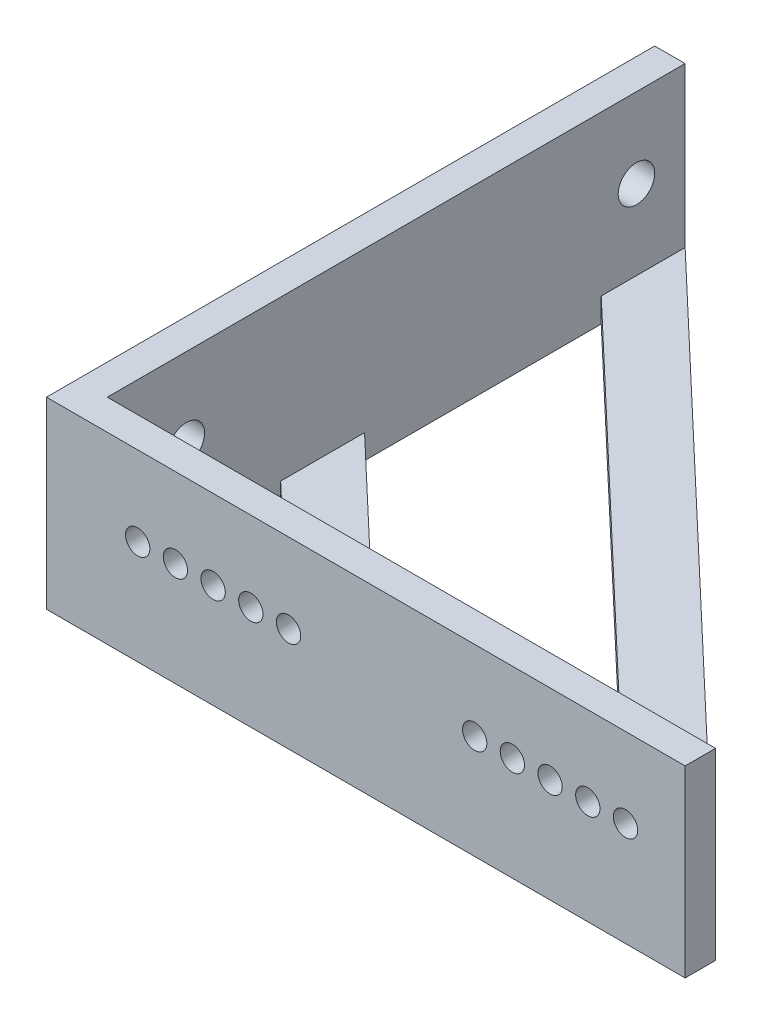
ISO-10303-21;
HEADER;
FILE_DESCRIPTION(('STEP AP214'),'2;1');
FILE_NAME('part.step','',(''),(''),'','','');
FILE_SCHEMA(('AUTOMOTIVE_DESIGN { 1 0 10303 214 1 1 1 1 }'));
ENDSEC;
DATA;
#1=APPLICATION_CONTEXT('core data for automotive mechanical design processes');
#2=APPLICATION_PROTOCOL_DEFINITION('international standard','automotive_design',2000,#1);
#3=PRODUCT_CONTEXT('',#1,'mechanical');
#4=PRODUCT('Part','Part','',(#3));
#5=PRODUCT_RELATED_PRODUCT_CATEGORY('part','',(#4));
#6=PRODUCT_DEFINITION_FORMATION('','',#4);
#7=PRODUCT_DEFINITION_CONTEXT('part definition',#1,'design');
#8=PRODUCT_DEFINITION('design','',#6,#7);
#9=PRODUCT_DEFINITION_SHAPE('','',#8);
#10=(LENGTH_UNIT() NAMED_UNIT(*) SI_UNIT(.MILLI.,.METRE.));
#11=(NAMED_UNIT(*) PLANE_ANGLE_UNIT() SI_UNIT($,.RADIAN.));
#12=(NAMED_UNIT(*) SI_UNIT($,.STERADIAN.) SOLID_ANGLE_UNIT());
#13=UNCERTAINTY_MEASURE_WITH_UNIT(LENGTH_MEASURE(1.E-05),#10,'distance_accuracy_value','');
#14=(GEOMETRIC_REPRESENTATION_CONTEXT(3) GLOBAL_UNCERTAINTY_ASSIGNED_CONTEXT((#13)) GLOBAL_UNIT_ASSIGNED_CONTEXT((#10,
#11,#12)) REPRESENTATION_CONTEXT('',''));
#15=CARTESIAN_POINT('',(0.,0.,0.));
#16=DIRECTION('',(0.,0.,1.));
#17=DIRECTION('',(1.,0.,0.));
#18=AXIS2_PLACEMENT_3D('',#15,#16,#17);
#19=CARTESIAN_POINT('',(100.042086618069,2.,-2.5));
#20=DIRECTION('',(0.,-1.,0.));
#21=DIRECTION('',(0.,0.,-1.));
#22=AXIS2_PLACEMENT_3D('',#19,#20,#21);
#23=PLANE('',#22);
#24=DIRECTION('',(0.,0.,1.));
#25=VECTOR('',#24,1.);
#26=CARTESIAN_POINT('',(2.5,2.,-2.5));
#27=LINE('',#26,#25);
#28=CARTESIAN_POINT('',(2.5,2.,-23.6465571120669));
#29=VERTEX_POINT('',#28);
#30=CARTESIAN_POINT('',(2.5,2.,-16.75));
#31=VERTEX_POINT('',#30);
#32=EDGE_CURVE('E187',#29,#31,#27,.T.);
#33=ORIENTED_EDGE('',*,*,#32,.T.);
#34=DIRECTION('',(-0.724999433594414,0.,-0.688749461914693));
#35=VECTOR('',#34,1.);
#36=CARTESIAN_POINT('',(17.5,2.,-2.5));
#37=LINE('',#36,#35);
#38=CARTESIAN_POINT('',(17.5,2.,-2.5));
#39=VERTEX_POINT('',#38);
#40=EDGE_CURVE('E152',#39,#31,#37,.T.);
#41=ORIENTED_EDGE('',*,*,#40,.F.);
#42=DIRECTION('',(-1.,0.,0.));
#43=VECTOR('',#42,1.);
#44=CARTESIAN_POINT('',(100.042086618069,2.,-2.5));
#45=LINE('',#44,#43);
#46=CARTESIAN_POINT('',(24.7595338021756,2.,-2.5));
#47=VERTEX_POINT('',#46);
#48=EDGE_CURVE('E139',#47,#39,#45,.T.);
#49=ORIENTED_EDGE('',*,*,#48,.F.);
#50=DIRECTION('',(0.724999433594414,0.,0.688749461914693));
#51=VECTOR('',#50,1.);
#52=CARTESIAN_POINT('',(2.5,2.,-23.6465571120669));
#53=LINE('',#52,#51);
#54=EDGE_CURVE('E173',#29,#47,#53,.T.);
#55=ORIENTED_EDGE('',*,*,#54,.F.);
#56=EDGE_LOOP('',(#33,#41,#49,#55));
#57=FACE_BOUND('',#56,.T.);
#58=ADVANCED_FACE('F38',(#57),#23,.F.);
#59=CARTESIAN_POINT('',(2.5,0.,0.));
#60=DIRECTION('',(-1.,0.,0.));
#61=DIRECTION('',(0.,0.,1.));
#62=AXIS2_PLACEMENT_3D('',#59,#60,#61);
#63=PLANE('',#62);
#64=CARTESIAN_POINT('',(2.5,8.55,-46.));
#65=DIRECTION('',(1.,0.,0.));
#66=DIRECTION('',(0.,0.,-1.));
#67=AXIS2_PLACEMENT_3D('',#64,#65,#66);
#68=CIRCLE('',#67,1.5);
#69=CARTESIAN_POINT('',(2.5,8.55,-47.5));
#70=VERTEX_POINT('',#69);
#71=EDGE_CURVE('E279',#70,#70,#68,.T.);
#72=ORIENTED_EDGE('',*,*,#71,.F.);
#73=EDGE_LOOP('',(#72));
#74=FACE_BOUND('',#73,.T.);
#75=CARTESIAN_POINT('',(2.5,8.55,-9.));
#76=DIRECTION('',(1.,0.,0.));
#77=DIRECTION('',(0.,0.,-1.));
#78=AXIS2_PLACEMENT_3D('',#75,#76,#77);
#79=CIRCLE('',#78,1.5);
#80=CARTESIAN_POINT('',(2.5,8.55,-10.5));
#81=VERTEX_POINT('',#80);
#82=EDGE_CURVE('E274',#81,#81,#79,.T.);
#83=ORIENTED_EDGE('',*,*,#82,.F.);
#84=EDGE_LOOP('',(#83));
#85=FACE_BOUND('',#84,.T.);
#86=CARTESIAN_POINT('',(2.5,2.,-50.));
#87=VERTEX_POINT('',#86);
#88=CARTESIAN_POINT('',(2.5,2.,-43.1034428879331));
#89=VERTEX_POINT('',#88);
#90=EDGE_CURVE('E193',#87,#89,#27,.T.);
#91=ORIENTED_EDGE('',*,*,#90,.F.);
#92=DIRECTION('',(0.,1.,0.));
#93=VECTOR('',#92,1.);
#94=CARTESIAN_POINT('',(2.5,0.,-50.));
#95=LINE('',#94,#93);
#96=CARTESIAN_POINT('',(2.5,15.1,-50.));
#97=VERTEX_POINT('',#96);
#98=EDGE_CURVE('E287',#87,#97,#95,.T.);
#99=ORIENTED_EDGE('',*,*,#98,.T.);
#100=DIRECTION('',(0.,0.,1.));
#101=VECTOR('',#100,1.);
#102=CARTESIAN_POINT('',(2.5,15.1,0.));
#103=LINE('',#102,#101);
#104=CARTESIAN_POINT('',(2.5,15.1,-2.5));
#105=VERTEX_POINT('',#104);
#106=EDGE_CURVE('E289',#97,#105,#103,.T.);
#107=ORIENTED_EDGE('',*,*,#106,.T.);
#108=DIRECTION('',(0.,1.,0.));
#109=VECTOR('',#108,1.);
#110=CARTESIAN_POINT('',(2.5,0.,-2.5));
#111=LINE('',#110,#109);
#112=CARTESIAN_POINT('',(2.5,0.,-2.5));
#113=VERTEX_POINT('',#112);
#114=EDGE_CURVE('E258',#113,#105,#111,.T.);
#115=ORIENTED_EDGE('',*,*,#114,.F.);
#116=DIRECTION('',(0.,0.,1.));
#117=VECTOR('',#116,1.);
#118=CARTESIAN_POINT('',(2.5,0.,-2.5));
#119=LINE('',#118,#117);
#120=CARTESIAN_POINT('',(2.5,0.,-16.75));
#121=VERTEX_POINT('',#120);
#122=EDGE_CURVE('E53',#121,#113,#119,.T.);
#123=ORIENTED_EDGE('',*,*,#122,.F.);
#124=DIRECTION('',(0.,1.,0.));
#125=VECTOR('',#124,1.);
#126=CARTESIAN_POINT('',(2.5,0.,-16.75));
#127=LINE('',#126,#125);
#128=EDGE_CURVE('E143',#121,#31,#127,.T.);
#129=ORIENTED_EDGE('',*,*,#128,.T.);
#130=ORIENTED_EDGE('',*,*,#32,.F.);
#131=DIRECTION('',(0.,1.,0.));
#132=VECTOR('',#131,1.);
#133=CARTESIAN_POINT('',(2.5,0.,-23.6465571120669));
#134=LINE('',#133,#132);
#135=CARTESIAN_POINT('',(2.5,0.,-23.6465571120669));
#136=VERTEX_POINT('',#135);
#137=EDGE_CURVE('E188',#136,#29,#134,.T.);
#138=ORIENTED_EDGE('',*,*,#137,.F.);
#139=DIRECTION('',(0.,0.,1.));
#140=VECTOR('',#139,1.);
#141=CARTESIAN_POINT('',(2.5,0.,-43.1034428879331));
#142=LINE('',#141,#140);
#143=CARTESIAN_POINT('',(2.5,0.,-43.1034428879331));
#144=VERTEX_POINT('',#143);
#145=EDGE_CURVE('E60',#144,#136,#142,.T.);
#146=ORIENTED_EDGE('',*,*,#145,.F.);
#147=DIRECTION('',(0.,1.,0.));
#148=VECTOR('',#147,1.);
#149=CARTESIAN_POINT('',(2.5,0.,-43.1034428879331));
#150=LINE('',#149,#148);
#151=EDGE_CURVE('E190',#144,#89,#150,.T.);
#152=ORIENTED_EDGE('',*,*,#151,.T.);
#153=EDGE_LOOP('',(#91,#99,#107,#115,#123,#129,#130,#138,#146,#152));
#154=FACE_BOUND('',#153,.T.);
#155=ADVANCED_FACE('F330',(#74,#85,#154),#63,.F.);
#156=CARTESIAN_POINT('',(52.5,0.,-2.5));
#157=DIRECTION('',(0.,0.,1.));
#158=DIRECTION('',(1.,0.,0.));
#159=AXIS2_PLACEMENT_3D('',#156,#157,#158);
#160=PLANE('',#159);
#161=CARTESIAN_POINT('',(47.5999999999998,8.54999999999991,-2.5));
#162=DIRECTION('',(0.,0.,-1.));
#163=DIRECTION('',(-1.,0.,0.));
#164=AXIS2_PLACEMENT_3D('',#161,#162,#163);
#165=CIRCLE('',#164,0.999999999999998);
#166=CARTESIAN_POINT('',(46.5999999999998,8.54999999999991,-2.5));
#167=VERTEX_POINT('',#166);
#168=EDGE_CURVE('E198',#167,#167,#165,.T.);
#169=ORIENTED_EDGE('',*,*,#168,.F.);
#170=EDGE_LOOP('',(#169));
#171=FACE_BOUND('',#170,.T.);
#172=CARTESIAN_POINT('',(16.7999999999999,8.54999999999993,-2.5));
#173=DIRECTION('',(0.,0.,-1.));
#174=DIRECTION('',(-1.,0.,0.));
#175=AXIS2_PLACEMENT_3D('',#172,#173,#174);
#176=CIRCLE('',#175,1.00000000000001);
#177=CARTESIAN_POINT('',(15.7999999999999,8.54999999999993,-2.5));
#178=VERTEX_POINT('',#177);
#179=EDGE_CURVE('E207',#178,#178,#176,.T.);
#180=ORIENTED_EDGE('',*,*,#179,.F.);
#181=EDGE_LOOP('',(#180));
#182=FACE_BOUND('',#181,.T.);
#183=CARTESIAN_POINT('',(13.6999999999999,8.54999999999995,-2.5));
#184=DIRECTION('',(0.,0.,-1.));
#185=DIRECTION('',(-1.,0.,0.));
#186=AXIS2_PLACEMENT_3D('',#183,#184,#185);
#187=CIRCLE('',#186,1.);
#188=CARTESIAN_POINT('',(12.6999999999999,8.54999999999995,-2.5));
#189=VERTEX_POINT('',#188);
#190=EDGE_CURVE('E217',#189,#189,#187,.T.);
#191=ORIENTED_EDGE('',*,*,#190,.F.);
#192=EDGE_LOOP('',(#191));
#193=FACE_BOUND('',#192,.T.);
#194=CARTESIAN_POINT('',(10.6,8.54999999999998,-2.5));
#195=DIRECTION('',(0.,0.,-1.));
#196=DIRECTION('',(-1.,0.,0.));
#197=AXIS2_PLACEMENT_3D('',#194,#195,#196);
#198=CIRCLE('',#197,1.);
#199=CARTESIAN_POINT('',(9.59999999999995,8.54999999999998,-2.5));
#200=VERTEX_POINT('',#199);
#201=EDGE_CURVE('E220',#200,#200,#198,.T.);
#202=ORIENTED_EDGE('',*,*,#201,.F.);
#203=EDGE_LOOP('',(#202));
#204=FACE_BOUND('',#203,.T.);
#205=CARTESIAN_POINT('',(35.1999999999998,8.55,-2.5));
#206=DIRECTION('',(0.,0.,-1.));
#207=DIRECTION('',(-1.,0.,0.));
#208=AXIS2_PLACEMENT_3D('',#205,#206,#207);
#209=CIRCLE('',#208,0.999999999999998);
#210=CARTESIAN_POINT('',(34.1999999999998,8.55,-2.5));
#211=VERTEX_POINT('',#210);
#212=EDGE_CURVE('E203',#211,#211,#209,.T.);
#213=ORIENTED_EDGE('',*,*,#212,.F.);
#214=EDGE_LOOP('',(#213));
#215=FACE_BOUND('',#214,.T.);
#216=CARTESIAN_POINT('',(19.8999999999998,8.54999999999991,-2.5));
#217=DIRECTION('',(0.,0.,-1.));
#218=DIRECTION('',(-1.,0.,0.));
#219=AXIS2_PLACEMENT_3D('',#216,#217,#218);
#220=CIRCLE('',#219,1.);
#221=CARTESIAN_POINT('',(18.8999999999998,8.54999999999991,-2.5));
#222=VERTEX_POINT('',#221);
#223=EDGE_CURVE('E204',#222,#222,#220,.T.);
#224=ORIENTED_EDGE('',*,*,#223,.F.);
#225=EDGE_LOOP('',(#224));
#226=FACE_BOUND('',#225,.T.);
#227=CARTESIAN_POINT('',(38.2999999999998,8.54999999999997,-2.5));
#228=DIRECTION('',(0.,0.,-1.));
#229=DIRECTION('',(-1.,0.,0.));
#230=AXIS2_PLACEMENT_3D('',#227,#228,#229);
#231=CIRCLE('',#230,0.999999999999998);
#232=CARTESIAN_POINT('',(37.2999999999998,8.54999999999997,-2.5));
#233=VERTEX_POINT('',#232);
#234=EDGE_CURVE('E208',#233,#233,#231,.T.);
#235=ORIENTED_EDGE('',*,*,#234,.F.);
#236=EDGE_LOOP('',(#235));
#237=FACE_BOUND('',#236,.T.);
#238=CARTESIAN_POINT('',(41.3999999999998,8.54999999999995,-2.5));
#239=DIRECTION('',(0.,0.,-1.));
#240=DIRECTION('',(-1.,0.,0.));
#241=AXIS2_PLACEMENT_3D('',#238,#239,#240);
#242=CIRCLE('',#241,0.999999999999998);
#243=CARTESIAN_POINT('',(40.3999999999998,8.54999999999995,-2.5));
#244=VERTEX_POINT('',#243);
#245=EDGE_CURVE('E211',#244,#244,#242,.T.);
#246=ORIENTED_EDGE('',*,*,#245,.F.);
#247=EDGE_LOOP('',(#246));
#248=FACE_BOUND('',#247,.T.);
#249=CARTESIAN_POINT('',(44.4999999999998,8.54999999999993,-2.5));
#250=DIRECTION('',(0.,0.,-1.));
#251=DIRECTION('',(-1.,0.,0.));
#252=AXIS2_PLACEMENT_3D('',#249,#250,#251);
#253=CIRCLE('',#252,0.999999999999998);
#254=CARTESIAN_POINT('',(43.4999999999998,8.54999999999993,-2.5));
#255=VERTEX_POINT('',#254);
#256=EDGE_CURVE('E214',#255,#255,#253,.T.);
#257=ORIENTED_EDGE('',*,*,#256,.F.);
#258=EDGE_LOOP('',(#257));
#259=FACE_BOUND('',#258,.T.);
#260=CARTESIAN_POINT('',(7.5,8.55,-2.5));
#261=DIRECTION('',(0.,0.,-1.));
#262=DIRECTION('',(-1.,0.,0.));
#263=AXIS2_PLACEMENT_3D('',#260,#261,#262);
#264=CIRCLE('',#263,1.0000000000001);
#265=CARTESIAN_POINT('',(6.4999999999999,8.55,-2.5));
#266=VERTEX_POINT('',#265);
#267=EDGE_CURVE('E199',#266,#266,#264,.T.);
#268=ORIENTED_EDGE('',*,*,#267,.F.);
#269=EDGE_LOOP('',(#268));
#270=FACE_BOUND('',#269,.T.);
#271=CARTESIAN_POINT('',(52.5,2.,-2.5));
#272=VERTEX_POINT('',#271);
#273=CARTESIAN_POINT('',(45.2404661978244,2.,-2.5));
#274=VERTEX_POINT('',#273);
#275=EDGE_CURVE('E196',#272,#274,#45,.T.);
#276=ORIENTED_EDGE('',*,*,#275,.T.);
#277=DIRECTION('',(0.,1.,0.));
#278=VECTOR('',#277,1.);
#279=CARTESIAN_POINT('',(45.2404661978244,0.,-2.5));
#280=LINE('',#279,#278);
#281=CARTESIAN_POINT('',(45.2404661978244,0.,-2.5));
#282=VERTEX_POINT('',#281);
#283=EDGE_CURVE('E180',#282,#274,#280,.T.);
#284=ORIENTED_EDGE('',*,*,#283,.F.);
#285=DIRECTION('',(1.,0.,0.));
#286=VECTOR('',#285,1.);
#287=CARTESIAN_POINT('',(24.7595338021756,0.,-2.5));
#288=LINE('',#287,#286);
#289=CARTESIAN_POINT('',(24.7595338021756,0.,-2.5));
#290=VERTEX_POINT('',#289);
#291=EDGE_CURVE('E169',#290,#282,#288,.T.);
#292=ORIENTED_EDGE('',*,*,#291,.F.);
#293=DIRECTION('',(0.,1.,0.));
#294=VECTOR('',#293,1.);
#295=CARTESIAN_POINT('',(24.7595338021756,0.,-2.5));
#296=LINE('',#295,#294);
#297=EDGE_CURVE('E185',#290,#47,#296,.T.);
#298=ORIENTED_EDGE('',*,*,#297,.T.);
#299=ORIENTED_EDGE('',*,*,#48,.T.);
#300=DIRECTION('',(0.,1.,0.));
#301=VECTOR('',#300,1.);
#302=CARTESIAN_POINT('',(17.5,0.,-2.5));
#303=LINE('',#302,#301);
#304=CARTESIAN_POINT('',(17.5,0.,-2.5));
#305=VERTEX_POINT('',#304);
#306=EDGE_CURVE('E132',#305,#39,#303,.T.);
#307=ORIENTED_EDGE('',*,*,#306,.F.);
#308=DIRECTION('',(1.,0.,0.));
#309=VECTOR('',#308,1.);
#310=CARTESIAN_POINT('',(17.5,0.,-2.5));
#311=LINE('',#310,#309);
#312=EDGE_CURVE('E137',#113,#305,#311,.T.);
#313=ORIENTED_EDGE('',*,*,#312,.F.);
#314=ORIENTED_EDGE('',*,*,#114,.T.);
#315=DIRECTION('',(-1.,0.,0.));
#316=VECTOR('',#315,1.);
#317=CARTESIAN_POINT('',(52.5,15.1,-2.5));
#318=LINE('',#317,#316);
#319=CARTESIAN_POINT('',(52.5,15.1,-2.5));
#320=VERTEX_POINT('',#319);
#321=EDGE_CURVE('E270',#320,#105,#318,.T.);
#322=ORIENTED_EDGE('',*,*,#321,.F.);
#323=DIRECTION('',(0.,1.,0.));
#324=VECTOR('',#323,1.);
#325=CARTESIAN_POINT('',(52.5,0.,-2.5));
#326=LINE('',#325,#324);
#327=EDGE_CURVE('E265',#272,#320,#326,.T.);
#328=ORIENTED_EDGE('',*,*,#327,.F.);
#329=EDGE_LOOP('',(#276,#284,#292,#298,#299,#307,#313,#314,#322,#328));
#330=FACE_BOUND('',#329,.T.);
#331=ADVANCED_FACE('F135',(#171,#182,#193,#204,#215,#226,#237,#248,#259,#270,#330),#160,.F.);
#332=CARTESIAN_POINT('',(2.5,0.,0.));
#333=DIRECTION('',(0.,0.,-1.));
#334=DIRECTION('',(-1.,0.,0.));
#335=AXIS2_PLACEMENT_3D('',#332,#333,#334);
#336=PLANE('',#335);
#337=CARTESIAN_POINT('',(7.5,8.55,0.));
#338=DIRECTION('',(0.,0.,-1.));
#339=DIRECTION('',(-1.,0.,0.));
#340=AXIS2_PLACEMENT_3D('',#337,#338,#339);
#341=CIRCLE('',#340,1.0000000000001);
#342=CARTESIAN_POINT('',(6.4999999999999,8.55,0.));
#343=VERTEX_POINT('',#342);
#344=EDGE_CURVE('E255',#343,#343,#341,.T.);
#345=ORIENTED_EDGE('',*,*,#344,.T.);
#346=EDGE_LOOP('',(#345));
#347=FACE_BOUND('',#346,.T.);
#348=CARTESIAN_POINT('',(44.4999999999998,8.54999999999993,0.));
#349=DIRECTION('',(0.,0.,-1.));
#350=DIRECTION('',(-1.,0.,0.));
#351=AXIS2_PLACEMENT_3D('',#348,#349,#350);
#352=CIRCLE('',#351,0.999999999999998);
#353=CARTESIAN_POINT('',(43.4999999999998,8.54999999999993,0.));
#354=VERTEX_POINT('',#353);
#355=EDGE_CURVE('E252',#354,#354,#352,.T.);
#356=ORIENTED_EDGE('',*,*,#355,.T.);
#357=EDGE_LOOP('',(#356));
#358=FACE_BOUND('',#357,.T.);
#359=CARTESIAN_POINT('',(41.3999999999998,8.54999999999995,0.));
#360=DIRECTION('',(0.,0.,-1.));
#361=DIRECTION('',(-1.,0.,0.));
#362=AXIS2_PLACEMENT_3D('',#359,#360,#361);
#363=CIRCLE('',#362,0.999999999999998);
#364=CARTESIAN_POINT('',(40.3999999999998,8.54999999999995,0.));
#365=VERTEX_POINT('',#364);
#366=EDGE_CURVE('E249',#365,#365,#363,.T.);
#367=ORIENTED_EDGE('',*,*,#366,.T.);
#368=EDGE_LOOP('',(#367));
#369=FACE_BOUND('',#368,.T.);
#370=CARTESIAN_POINT('',(38.2999999999998,8.54999999999997,0.));
#371=DIRECTION('',(0.,0.,-1.));
#372=DIRECTION('',(-1.,0.,0.));
#373=AXIS2_PLACEMENT_3D('',#370,#371,#372);
#374=CIRCLE('',#373,0.999999999999998);
#375=CARTESIAN_POINT('',(37.2999999999998,8.54999999999997,0.));
#376=VERTEX_POINT('',#375);
#377=EDGE_CURVE('E246',#376,#376,#374,.T.);
#378=ORIENTED_EDGE('',*,*,#377,.T.);
#379=EDGE_LOOP('',(#378));
#380=FACE_BOUND('',#379,.T.);
#381=CARTESIAN_POINT('',(19.8999999999998,8.54999999999991,0.));
#382=DIRECTION('',(0.,0.,-1.));
#383=DIRECTION('',(-1.,0.,0.));
#384=AXIS2_PLACEMENT_3D('',#381,#382,#383);
#385=CIRCLE('',#384,1.);
#386=CARTESIAN_POINT('',(18.8999999999998,8.54999999999991,0.));
#387=VERTEX_POINT('',#386);
#388=EDGE_CURVE('E243',#387,#387,#385,.T.);
#389=ORIENTED_EDGE('',*,*,#388,.T.);
#390=EDGE_LOOP('',(#389));
#391=FACE_BOUND('',#390,.T.);
#392=CARTESIAN_POINT('',(35.1999999999998,8.55,0.));
#393=DIRECTION('',(0.,0.,-1.));
#394=DIRECTION('',(-1.,0.,0.));
#395=AXIS2_PLACEMENT_3D('',#392,#393,#394);
#396=CIRCLE('',#395,0.999999999999998);
#397=CARTESIAN_POINT('',(34.1999999999998,8.55,0.));
#398=VERTEX_POINT('',#397);
#399=EDGE_CURVE('E240',#398,#398,#396,.T.);
#400=ORIENTED_EDGE('',*,*,#399,.T.);
#401=EDGE_LOOP('',(#400));
#402=FACE_BOUND('',#401,.T.);
#403=CARTESIAN_POINT('',(10.6,8.54999999999998,0.));
#404=DIRECTION('',(0.,0.,-1.));
#405=DIRECTION('',(-1.,0.,0.));
#406=AXIS2_PLACEMENT_3D('',#403,#404,#405);
#407=CIRCLE('',#406,1.);
#408=CARTESIAN_POINT('',(9.59999999999995,8.54999999999998,0.));
#409=VERTEX_POINT('',#408);
#410=EDGE_CURVE('E237',#409,#409,#407,.T.);
#411=ORIENTED_EDGE('',*,*,#410,.T.);
#412=EDGE_LOOP('',(#411));
#413=FACE_BOUND('',#412,.T.);
#414=CARTESIAN_POINT('',(13.6999999999999,8.54999999999995,0.));
#415=DIRECTION('',(0.,0.,-1.));
#416=DIRECTION('',(-1.,0.,0.));
#417=AXIS2_PLACEMENT_3D('',#414,#415,#416);
#418=CIRCLE('',#417,1.);
#419=CARTESIAN_POINT('',(12.6999999999999,8.54999999999995,0.));
#420=VERTEX_POINT('',#419);
#421=EDGE_CURVE('E234',#420,#420,#418,.T.);
#422=ORIENTED_EDGE('',*,*,#421,.T.);
#423=EDGE_LOOP('',(#422));
#424=FACE_BOUND('',#423,.T.);
#425=CARTESIAN_POINT('',(16.7999999999999,8.54999999999993,0.));
#426=DIRECTION('',(0.,0.,-1.));
#427=DIRECTION('',(-1.,0.,0.));
#428=AXIS2_PLACEMENT_3D('',#425,#426,#427);
#429=CIRCLE('',#428,1.00000000000001);
#430=CARTESIAN_POINT('',(15.7999999999999,8.54999999999993,0.));
#431=VERTEX_POINT('',#430);
#432=EDGE_CURVE('E231',#431,#431,#429,.T.);
#433=ORIENTED_EDGE('',*,*,#432,.T.);
#434=EDGE_LOOP('',(#433));
#435=FACE_BOUND('',#434,.T.);
#436=CARTESIAN_POINT('',(47.5999999999998,8.54999999999991,0.));
#437=DIRECTION('',(0.,0.,-1.));
#438=DIRECTION('',(-1.,0.,0.));
#439=AXIS2_PLACEMENT_3D('',#436,#437,#438);
#440=CIRCLE('',#439,0.999999999999998);
#441=CARTESIAN_POINT('',(46.5999999999998,8.54999999999991,0.));
#442=VERTEX_POINT('',#441);
#443=EDGE_CURVE('E202',#442,#442,#440,.T.);
#444=ORIENTED_EDGE('',*,*,#443,.T.);
#445=EDGE_LOOP('',(#444));
#446=FACE_BOUND('',#445,.T.);
#447=DIRECTION('',(0.,-1.,0.));
#448=VECTOR('',#447,1.);
#449=CARTESIAN_POINT('',(0.,0.,0.));
#450=LINE('',#449,#448);
#451=CARTESIAN_POINT('',(0.,15.1,0.));
#452=VERTEX_POINT('',#451);
#453=CARTESIAN_POINT('',(0.,0.,0.));
#454=VERTEX_POINT('',#453);
#455=EDGE_CURVE('E278',#452,#454,#450,.T.);
#456=ORIENTED_EDGE('',*,*,#455,.T.);
#457=DIRECTION('',(-1.,0.,0.));
#458=VECTOR('',#457,1.);
#459=CARTESIAN_POINT('',(2.5,0.,0.));
#460=LINE('',#459,#458);
#461=CARTESIAN_POINT('',(52.5,0.,0.));
#462=VERTEX_POINT('',#461);
#463=EDGE_CURVE('E11',#462,#454,#460,.T.);
#464=ORIENTED_EDGE('',*,*,#463,.F.);
#465=DIRECTION('',(0.,-1.,0.));
#466=VECTOR('',#465,1.);
#467=CARTESIAN_POINT('',(52.5,0.,0.));
#468=LINE('',#467,#466);
#469=CARTESIAN_POINT('',(52.5,15.1,0.));
#470=VERTEX_POINT('',#469);
#471=EDGE_CURVE('E259',#470,#462,#468,.T.);
#472=ORIENTED_EDGE('',*,*,#471,.F.);
#473=DIRECTION('',(-1.,0.,0.));
#474=VECTOR('',#473,1.);
#475=CARTESIAN_POINT('',(2.5,15.1,0.));
#476=LINE('',#475,#474);
#477=EDGE_CURVE('E293',#470,#452,#476,.T.);
#478=ORIENTED_EDGE('',*,*,#477,.T.);
#479=EDGE_LOOP('',(#456,#464,#472,#478));
#480=FACE_BOUND('',#479,.T.);
#481=ADVANCED_FACE('F40',(#347,#358,#369,#380,#391,#402,#413,#424,#435,#446,#480),#336,.F.);
#482=CARTESIAN_POINT('',(2.5,0.,0.));
#483=DIRECTION('',(0.,1.,0.));
#484=DIRECTION('',(0.,0.,1.));
#485=AXIS2_PLACEMENT_3D('',#482,#483,#484);
#486=PLANE('',#485);
#487=ORIENTED_EDGE('',*,*,#122,.T.);
#488=ORIENTED_EDGE('',*,*,#312,.T.);
#489=DIRECTION('',(-0.724999433594414,0.,-0.688749461914693));
#490=VECTOR('',#489,1.);
#491=CARTESIAN_POINT('',(17.5,0.,-2.5));
#492=LINE('',#491,#490);
#493=EDGE_CURVE('E146',#305,#121,#492,.T.);
#494=ORIENTED_EDGE('',*,*,#493,.T.);
#495=EDGE_LOOP('',(#487,#488,#494));
#496=FACE_BOUND('',#495,.T.);
#497=DIRECTION('',(0.724999433594414,0.,0.688749461914693));
#498=VECTOR('',#497,1.);
#499=CARTESIAN_POINT('',(2.5,0.,-23.6465571120669));
#500=LINE('',#499,#498);
#501=EDGE_CURVE('E177',#136,#290,#500,.T.);
#502=ORIENTED_EDGE('',*,*,#501,.T.);
#503=ORIENTED_EDGE('',*,*,#291,.T.);
#504=DIRECTION('',(-0.724999433594414,0.,-0.688749461914693));
#505=VECTOR('',#504,1.);
#506=CARTESIAN_POINT('',(45.2404661978244,0.,-2.5));
#507=LINE('',#506,#505);
#508=EDGE_CURVE('E172',#282,#144,#507,.T.);
#509=ORIENTED_EDGE('',*,*,#508,.T.);
#510=ORIENTED_EDGE('',*,*,#145,.T.);
#511=EDGE_LOOP('',(#502,#503,#509,#510));
#512=FACE_BOUND('',#511,.T.);
#513=DIRECTION('',(-1.,0.,0.));
#514=VECTOR('',#513,1.);
#515=CARTESIAN_POINT('',(2.5,0.,-50.));
#516=LINE('',#515,#514);
#517=CARTESIAN_POINT('',(2.5,0.,-50.));
#518=VERTEX_POINT('',#517);
#519=CARTESIAN_POINT('',(0.,0.,-50.));
#520=VERTEX_POINT('',#519);
#521=EDGE_CURVE('E46',#518,#520,#516,.T.);
#522=ORIENTED_EDGE('',*,*,#521,.F.);
#523=DIRECTION('',(0.724999433594414,0.,0.688749461914693));
#524=VECTOR('',#523,1.);
#525=CARTESIAN_POINT('',(52.5,0.,-2.5));
#526=LINE('',#525,#524);
#527=CARTESIAN_POINT('',(52.5,0.,-2.5));
#528=VERTEX_POINT('',#527);
#529=EDGE_CURVE('E159',#518,#528,#526,.T.);
#530=ORIENTED_EDGE('',*,*,#529,.T.);
#531=DIRECTION('',(0.,0.,-1.));
#532=VECTOR('',#531,1.);
#533=CARTESIAN_POINT('',(52.5,0.,0.));
#534=LINE('',#533,#532);
#535=EDGE_CURVE('E262',#462,#528,#534,.T.);
#536=ORIENTED_EDGE('',*,*,#535,.F.);
#537=ORIENTED_EDGE('',*,*,#463,.T.);
#538=DIRECTION('',(0.,0.,-1.));
#539=VECTOR('',#538,1.);
#540=CARTESIAN_POINT('',(0.,0.,0.));
#541=LINE('',#540,#539);
#542=EDGE_CURVE('E296',#454,#520,#541,.T.);
#543=ORIENTED_EDGE('',*,*,#542,.T.);
#544=EDGE_LOOP('',(#522,#530,#536,#537,#543));
#545=FACE_BOUND('',#544,.T.);
#546=ADVANCED_FACE('F150',(#496,#512,#545),#486,.F.);
#547=CARTESIAN_POINT('',(2.5,0.,-50.));
#548=DIRECTION('',(0.,0.,1.));
#549=DIRECTION('',(1.,0.,0.));
#550=AXIS2_PLACEMENT_3D('',#547,#548,#549);
#551=PLANE('',#550);
#552=ORIENTED_EDGE('',*,*,#98,.F.);
#553=DIRECTION('',(0.,1.,0.));
#554=VECTOR('',#553,1.);
#555=CARTESIAN_POINT('',(2.5,0.,-50.));
#556=LINE('',#555,#554);
#557=EDGE_CURVE('E162',#518,#87,#556,.T.);
#558=ORIENTED_EDGE('',*,*,#557,.F.);
#559=ORIENTED_EDGE('',*,*,#521,.T.);
#560=DIRECTION('',(0.,1.,0.));
#561=VECTOR('',#560,1.);
#562=CARTESIAN_POINT('',(0.,0.,-50.));
#563=LINE('',#562,#561);
#564=CARTESIAN_POINT('',(0.,15.1,-50.));
#565=VERTEX_POINT('',#564);
#566=EDGE_CURVE('E299',#520,#565,#563,.T.);
#567=ORIENTED_EDGE('',*,*,#566,.T.);
#568=DIRECTION('',(-1.,0.,0.));
#569=VECTOR('',#568,1.);
#570=CARTESIAN_POINT('',(2.5,15.1,-50.));
#571=LINE('',#570,#569);
#572=EDGE_CURVE('E304',#97,#565,#571,.T.);
#573=ORIENTED_EDGE('',*,*,#572,.F.);
#574=EDGE_LOOP('',(#552,#558,#559,#567,#573));
#575=FACE_BOUND('',#574,.T.);
#576=ADVANCED_FACE('F310',(#575),#551,.F.);
#577=CARTESIAN_POINT('',(2.5,15.1,0.));
#578=DIRECTION('',(0.,-1.,0.));
#579=DIRECTION('',(0.,0.,-1.));
#580=AXIS2_PLACEMENT_3D('',#577,#578,#579);
#581=PLANE('',#580);
#582=DIRECTION('',(0.,0.,1.));
#583=VECTOR('',#582,1.);
#584=CARTESIAN_POINT('',(0.,15.1,0.));
#585=LINE('',#584,#583);
#586=EDGE_CURVE('E290',#565,#452,#585,.T.);
#587=ORIENTED_EDGE('',*,*,#586,.T.);
#588=ORIENTED_EDGE('',*,*,#477,.F.);
#589=DIRECTION('',(0.,0.,1.));
#590=VECTOR('',#589,1.);
#591=CARTESIAN_POINT('',(52.5,15.1,0.));
#592=LINE('',#591,#590);
#593=EDGE_CURVE('E267',#320,#470,#592,.T.);
#594=ORIENTED_EDGE('',*,*,#593,.F.);
#595=ORIENTED_EDGE('',*,*,#321,.T.);
#596=ORIENTED_EDGE('',*,*,#106,.F.);
#597=ORIENTED_EDGE('',*,*,#572,.T.);
#598=EDGE_LOOP('',(#587,#588,#594,#595,#596,#597));
#599=FACE_BOUND('',#598,.T.);
#600=ADVANCED_FACE('F320',(#599),#581,.F.);
#601=CARTESIAN_POINT('',(0.,0.,0.));
#602=DIRECTION('',(-1.,0.,0.));
#603=DIRECTION('',(0.,0.,1.));
#604=AXIS2_PLACEMENT_3D('',#601,#602,#603);
#605=PLANE('',#604);
#606=CARTESIAN_POINT('',(0.,8.55,-46.));
#607=DIRECTION('',(1.,0.,0.));
#608=DIRECTION('',(0.,0.,-1.));
#609=AXIS2_PLACEMENT_3D('',#606,#607,#608);
#610=CIRCLE('',#609,1.5);
#611=CARTESIAN_POINT('',(0.,8.55,-47.5));
#612=VERTEX_POINT('',#611);
#613=EDGE_CURVE('E275',#612,#612,#610,.T.);
#614=ORIENTED_EDGE('',*,*,#613,.T.);
#615=EDGE_LOOP('',(#614));
#616=FACE_BOUND('',#615,.T.);
#617=CARTESIAN_POINT('',(0.,8.55,-9.));
#618=DIRECTION('',(1.,0.,0.));
#619=DIRECTION('',(0.,0.,-1.));
#620=AXIS2_PLACEMENT_3D('',#617,#618,#619);
#621=CIRCLE('',#620,1.5);
#622=CARTESIAN_POINT('',(0.,8.55,-10.5));
#623=VERTEX_POINT('',#622);
#624=EDGE_CURVE('E282',#623,#623,#621,.T.);
#625=ORIENTED_EDGE('',*,*,#624,.T.);
#626=EDGE_LOOP('',(#625));
#627=FACE_BOUND('',#626,.T.);
#628=ORIENTED_EDGE('',*,*,#455,.F.);
#629=ORIENTED_EDGE('',*,*,#586,.F.);
#630=ORIENTED_EDGE('',*,*,#566,.F.);
#631=ORIENTED_EDGE('',*,*,#542,.F.);
#632=EDGE_LOOP('',(#628,#629,#630,#631));
#633=FACE_BOUND('',#632,.T.);
#634=ADVANCED_FACE('F318',(#616,#627,#633),#605,.T.);
#635=CARTESIAN_POINT('',(0.,8.55,-9.));
#636=DIRECTION('',(1.,0.,0.));
#637=DIRECTION('',(0.,0.,-1.));
#638=AXIS2_PLACEMENT_3D('',#635,#636,#637);
#639=CYLINDRICAL_SURFACE('',#638,1.5);
#640=ORIENTED_EDGE('',*,*,#624,.F.);
#641=EDGE_LOOP('',(#640));
#642=FACE_BOUND('',#641,.T.);
#643=ORIENTED_EDGE('',*,*,#82,.T.);
#644=EDGE_LOOP('',(#643));
#645=FACE_BOUND('',#644,.T.);
#646=ADVANCED_FACE('F414',(#642,#645),#639,.F.);
#647=CARTESIAN_POINT('',(0.,8.55,-46.));
#648=DIRECTION('',(1.,0.,0.));
#649=DIRECTION('',(0.,0.,-1.));
#650=AXIS2_PLACEMENT_3D('',#647,#648,#649);
#651=CYLINDRICAL_SURFACE('',#650,1.5);
#652=ORIENTED_EDGE('',*,*,#613,.F.);
#653=EDGE_LOOP('',(#652));
#654=FACE_BOUND('',#653,.T.);
#655=ORIENTED_EDGE('',*,*,#71,.T.);
#656=EDGE_LOOP('',(#655));
#657=FACE_BOUND('',#656,.T.);
#658=ADVANCED_FACE('F408',(#654,#657),#651,.F.);
#659=CARTESIAN_POINT('',(52.5,0.,0.));
#660=DIRECTION('',(-1.,0.,0.));
#661=DIRECTION('',(0.,0.,1.));
#662=AXIS2_PLACEMENT_3D('',#659,#660,#661);
#663=PLANE('',#662);
#664=ORIENTED_EDGE('',*,*,#535,.T.);
#665=DIRECTION('',(0.,1.,0.));
#666=VECTOR('',#665,1.);
#667=CARTESIAN_POINT('',(52.5,0.,-2.5));
#668=LINE('',#667,#666);
#669=EDGE_CURVE('E164',#528,#272,#668,.T.);
#670=ORIENTED_EDGE('',*,*,#669,.T.);
#671=ORIENTED_EDGE('',*,*,#327,.T.);
#672=ORIENTED_EDGE('',*,*,#593,.T.);
#673=ORIENTED_EDGE('',*,*,#471,.T.);
#674=EDGE_LOOP('',(#664,#670,#671,#672,#673));
#675=FACE_BOUND('',#674,.T.);
#676=ADVANCED_FACE('F326',(#675),#663,.F.);
#677=CARTESIAN_POINT('',(47.5999999999998,8.54999999999991,42.5));
#678=DIRECTION('',(0.,0.,-1.));
#679=DIRECTION('',(-1.,0.,0.));
#680=AXIS2_PLACEMENT_3D('',#677,#678,#679);
#681=CYLINDRICAL_SURFACE('',#680,0.999999999999998);
#682=ORIENTED_EDGE('',*,*,#168,.T.);
#683=EDGE_LOOP('',(#682));
#684=FACE_BOUND('',#683,.T.);
#685=ORIENTED_EDGE('',*,*,#443,.F.);
#686=EDGE_LOOP('',(#685));
#687=FACE_BOUND('',#686,.T.);
#688=ADVANCED_FACE('F395',(#684,#687),#681,.F.);
#689=CARTESIAN_POINT('',(16.7999999999999,8.54999999999993,42.5));
#690=DIRECTION('',(0.,0.,-1.));
#691=DIRECTION('',(-1.,0.,0.));
#692=AXIS2_PLACEMENT_3D('',#689,#690,#691);
#693=CYLINDRICAL_SURFACE('',#692,1.00000000000001);
#694=ORIENTED_EDGE('',*,*,#179,.T.);
#695=EDGE_LOOP('',(#694));
#696=FACE_BOUND('',#695,.T.);
#697=ORIENTED_EDGE('',*,*,#432,.F.);
#698=EDGE_LOOP('',(#697));
#699=FACE_BOUND('',#698,.T.);
#700=ADVANCED_FACE('F391',(#696,#699),#693,.F.);
#701=CARTESIAN_POINT('',(13.6999999999999,8.54999999999995,42.5));
#702=DIRECTION('',(0.,0.,-1.));
#703=DIRECTION('',(-1.,0.,0.));
#704=AXIS2_PLACEMENT_3D('',#701,#702,#703);
#705=CYLINDRICAL_SURFACE('',#704,1.);
#706=ORIENTED_EDGE('',*,*,#190,.T.);
#707=EDGE_LOOP('',(#706));
#708=FACE_BOUND('',#707,.T.);
#709=ORIENTED_EDGE('',*,*,#421,.F.);
#710=EDGE_LOOP('',(#709));
#711=FACE_BOUND('',#710,.T.);
#712=ADVANCED_FACE('F387',(#708,#711),#705,.F.);
#713=CARTESIAN_POINT('',(10.6,8.54999999999998,42.5));
#714=DIRECTION('',(0.,0.,-1.));
#715=DIRECTION('',(-1.,0.,0.));
#716=AXIS2_PLACEMENT_3D('',#713,#714,#715);
#717=CYLINDRICAL_SURFACE('',#716,1.);
#718=ORIENTED_EDGE('',*,*,#201,.T.);
#719=EDGE_LOOP('',(#718));
#720=FACE_BOUND('',#719,.T.);
#721=ORIENTED_EDGE('',*,*,#410,.F.);
#722=EDGE_LOOP('',(#721));
#723=FACE_BOUND('',#722,.T.);
#724=ADVANCED_FACE('F390',(#720,#723),#717,.F.);
#725=CARTESIAN_POINT('',(35.1999999999998,8.55,42.5));
#726=DIRECTION('',(0.,0.,-1.));
#727=DIRECTION('',(-1.,0.,0.));
#728=AXIS2_PLACEMENT_3D('',#725,#726,#727);
#729=CYLINDRICAL_SURFACE('',#728,0.999999999999998);
#730=ORIENTED_EDGE('',*,*,#212,.T.);
#731=EDGE_LOOP('',(#730));
#732=FACE_BOUND('',#731,.T.);
#733=ORIENTED_EDGE('',*,*,#399,.F.);
#734=EDGE_LOOP('',(#733));
#735=FACE_BOUND('',#734,.T.);
#736=ADVANCED_FACE('F379',(#732,#735),#729,.F.);
#737=CARTESIAN_POINT('',(19.8999999999998,8.54999999999991,42.5));
#738=DIRECTION('',(0.,0.,-1.));
#739=DIRECTION('',(-1.,0.,0.));
#740=AXIS2_PLACEMENT_3D('',#737,#738,#739);
#741=CYLINDRICAL_SURFACE('',#740,1.);
#742=ORIENTED_EDGE('',*,*,#223,.T.);
#743=EDGE_LOOP('',(#742));
#744=FACE_BOUND('',#743,.T.);
#745=ORIENTED_EDGE('',*,*,#388,.F.);
#746=EDGE_LOOP('',(#745));
#747=FACE_BOUND('',#746,.T.);
#748=ADVANCED_FACE('F375',(#744,#747),#741,.F.);
#749=CARTESIAN_POINT('',(38.2999999999998,8.54999999999997,42.5));
#750=DIRECTION('',(0.,0.,-1.));
#751=DIRECTION('',(-1.,0.,0.));
#752=AXIS2_PLACEMENT_3D('',#749,#750,#751);
#753=CYLINDRICAL_SURFACE('',#752,0.999999999999998);
#754=ORIENTED_EDGE('',*,*,#234,.T.);
#755=EDGE_LOOP('',(#754));
#756=FACE_BOUND('',#755,.T.);
#757=ORIENTED_EDGE('',*,*,#377,.F.);
#758=EDGE_LOOP('',(#757));
#759=FACE_BOUND('',#758,.T.);
#760=ADVANCED_FACE('F378',(#756,#759),#753,.F.);
#761=CARTESIAN_POINT('',(41.3999999999998,8.54999999999995,42.5));
#762=DIRECTION('',(0.,0.,-1.));
#763=DIRECTION('',(-1.,0.,0.));
#764=AXIS2_PLACEMENT_3D('',#761,#762,#763);
#765=CYLINDRICAL_SURFACE('',#764,0.999999999999998);
#766=ORIENTED_EDGE('',*,*,#245,.T.);
#767=EDGE_LOOP('',(#766));
#768=FACE_BOUND('',#767,.T.);
#769=ORIENTED_EDGE('',*,*,#366,.F.);
#770=EDGE_LOOP('',(#769));
#771=FACE_BOUND('',#770,.T.);
#772=ADVANCED_FACE('F370',(#768,#771),#765,.F.);
#773=CARTESIAN_POINT('',(44.4999999999998,8.54999999999993,42.5));
#774=DIRECTION('',(0.,0.,-1.));
#775=DIRECTION('',(-1.,0.,0.));
#776=AXIS2_PLACEMENT_3D('',#773,#774,#775);
#777=CYLINDRICAL_SURFACE('',#776,0.999999999999998);
#778=ORIENTED_EDGE('',*,*,#256,.T.);
#779=EDGE_LOOP('',(#778));
#780=FACE_BOUND('',#779,.T.);
#781=ORIENTED_EDGE('',*,*,#355,.F.);
#782=EDGE_LOOP('',(#781));
#783=FACE_BOUND('',#782,.T.);
#784=ADVANCED_FACE('F365',(#780,#783),#777,.F.);
#785=CARTESIAN_POINT('',(7.5,8.55,42.5));
#786=DIRECTION('',(0.,0.,-1.));
#787=DIRECTION('',(-1.,0.,0.));
#788=AXIS2_PLACEMENT_3D('',#785,#786,#787);
#789=CYLINDRICAL_SURFACE('',#788,1.0000000000001);
#790=ORIENTED_EDGE('',*,*,#267,.T.);
#791=EDGE_LOOP('',(#790));
#792=FACE_BOUND('',#791,.T.);
#793=ORIENTED_EDGE('',*,*,#344,.F.);
#794=EDGE_LOOP('',(#793));
#795=FACE_BOUND('',#794,.T.);
#796=ADVANCED_FACE('F359',(#792,#795),#789,.F.);
#797=ORIENTED_EDGE('',*,*,#275,.F.);
#798=DIRECTION('',(0.724999433594414,0.,0.688749461914693));
#799=VECTOR('',#798,1.);
#800=CARTESIAN_POINT('',(52.5,2.,-2.5));
#801=LINE('',#800,#799);
#802=EDGE_CURVE('E157',#87,#272,#801,.T.);
#803=ORIENTED_EDGE('',*,*,#802,.F.);
#804=ORIENTED_EDGE('',*,*,#90,.T.);
#805=DIRECTION('',(-0.724999433594414,0.,-0.688749461914693));
#806=VECTOR('',#805,1.);
#807=CARTESIAN_POINT('',(45.2404661978244,2.,-2.5));
#808=LINE('',#807,#806);
#809=EDGE_CURVE('E167',#274,#89,#808,.T.);
#810=ORIENTED_EDGE('',*,*,#809,.F.);
#811=EDGE_LOOP('',(#797,#803,#804,#810));
#812=FACE_BOUND('',#811,.T.);
#813=ADVANCED_FACE('F335',(#812),#23,.F.);
#814=CARTESIAN_POINT('',(2.5,0.,-23.6465571120669));
#815=DIRECTION('',(-0.688749461914693,0.,0.724999433594414));
#816=DIRECTION('',(0.724999433594414,0.,0.688749461914693));
#817=AXIS2_PLACEMENT_3D('',#814,#815,#816);
#818=PLANE('',#817);
#819=ORIENTED_EDGE('',*,*,#54,.T.);
#820=ORIENTED_EDGE('',*,*,#297,.F.);
#821=ORIENTED_EDGE('',*,*,#501,.F.);
#822=ORIENTED_EDGE('',*,*,#137,.T.);
#823=EDGE_LOOP('',(#819,#820,#821,#822));
#824=FACE_BOUND('',#823,.T.);
#825=ADVANCED_FACE('F358',(#824),#818,.F.);
#826=CARTESIAN_POINT('',(45.2404661978244,0.,-2.5));
#827=DIRECTION('',(0.688749461914693,0.,-0.724999433594414));
#828=DIRECTION('',(-0.724999433594414,0.,-0.688749461914693));
#829=AXIS2_PLACEMENT_3D('',#826,#827,#828);
#830=PLANE('',#829);
#831=ORIENTED_EDGE('',*,*,#809,.T.);
#832=ORIENTED_EDGE('',*,*,#151,.F.);
#833=ORIENTED_EDGE('',*,*,#508,.F.);
#834=ORIENTED_EDGE('',*,*,#283,.T.);
#835=EDGE_LOOP('',(#831,#832,#833,#834));
#836=FACE_BOUND('',#835,.T.);
#837=ADVANCED_FACE('F343',(#836),#830,.F.);
#838=CARTESIAN_POINT('',(17.5,0.,-2.5));
#839=DIRECTION('',(0.688749461914693,0.,-0.724999433594414));
#840=DIRECTION('',(-0.724999433594414,0.,-0.688749461914693));
#841=AXIS2_PLACEMENT_3D('',#838,#839,#840);
#842=PLANE('',#841);
#843=ORIENTED_EDGE('',*,*,#40,.T.);
#844=ORIENTED_EDGE('',*,*,#128,.F.);
#845=ORIENTED_EDGE('',*,*,#493,.F.);
#846=ORIENTED_EDGE('',*,*,#306,.T.);
#847=EDGE_LOOP('',(#843,#844,#845,#846));
#848=FACE_BOUND('',#847,.T.);
#849=ADVANCED_FACE('F147',(#848),#842,.F.);
#850=CARTESIAN_POINT('',(52.5,0.,-2.5));
#851=DIRECTION('',(-0.688749461914693,0.,0.724999433594414));
#852=DIRECTION('',(0.724999433594414,0.,0.688749461914693));
#853=AXIS2_PLACEMENT_3D('',#850,#851,#852);
#854=PLANE('',#853);
#855=ORIENTED_EDGE('',*,*,#802,.T.);
#856=ORIENTED_EDGE('',*,*,#669,.F.);
#857=ORIENTED_EDGE('',*,*,#529,.F.);
#858=ORIENTED_EDGE('',*,*,#557,.T.);
#859=EDGE_LOOP('',(#855,#856,#857,#858));
#860=FACE_BOUND('',#859,.T.);
#861=ADVANCED_FACE('F337',(#860),#854,.F.);
#862=CLOSED_SHELL('',(#58,#155,#331,#481,#546,#576,#600,#634,#646,#658,#676,#688,#700,#712,#724,
#736,#748,#760,#772,#784,#796,#813,#825,#837,#849,#861));
#863=MANIFOLD_SOLID_BREP('B2',#862);
#864=ADVANCED_BREP_SHAPE_REPRESENTATION('',(#18,#863),#14);
#865=SHAPE_DEFINITION_REPRESENTATION(#9,#864);
ENDSEC;
END-ISO-10303-21;
